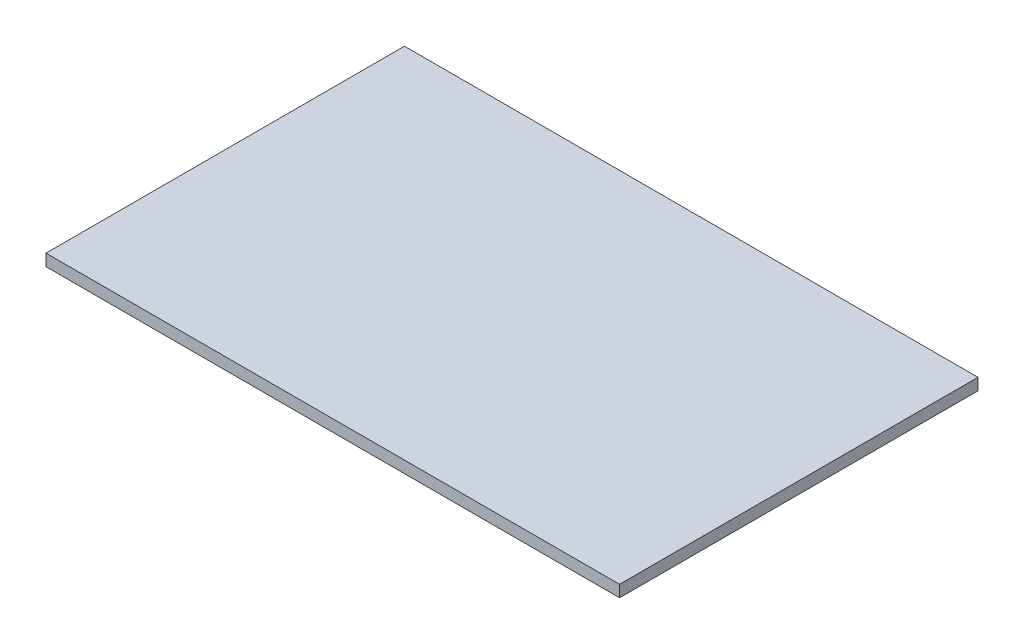
ISO-10303-21;
HEADER;
FILE_DESCRIPTION(('STEP AP214'),'2;1');
FILE_NAME('part.step','',(''),(''),'','','');
FILE_SCHEMA(('AUTOMOTIVE_DESIGN { 1 0 10303 214 1 1 1 1 }'));
ENDSEC;
DATA;
#1=APPLICATION_CONTEXT('core data for automotive mechanical design processes');
#2=APPLICATION_PROTOCOL_DEFINITION('international standard','automotive_design',2000,#1);
#3=PRODUCT_CONTEXT('',#1,'mechanical');
#4=PRODUCT('Part','Part','',(#3));
#5=PRODUCT_RELATED_PRODUCT_CATEGORY('part','',(#4));
#6=PRODUCT_DEFINITION_FORMATION('','',#4);
#7=PRODUCT_DEFINITION_CONTEXT('part definition',#1,'design');
#8=PRODUCT_DEFINITION('design','',#6,#7);
#9=PRODUCT_DEFINITION_SHAPE('','',#8);
#10=(LENGTH_UNIT() NAMED_UNIT(*) SI_UNIT(.MILLI.,.METRE.));
#11=(NAMED_UNIT(*) PLANE_ANGLE_UNIT() SI_UNIT($,.RADIAN.));
#12=(NAMED_UNIT(*) SI_UNIT($,.STERADIAN.) SOLID_ANGLE_UNIT());
#13=UNCERTAINTY_MEASURE_WITH_UNIT(LENGTH_MEASURE(1.E-05),#10,'distance_accuracy_value','');
#14=(GEOMETRIC_REPRESENTATION_CONTEXT(3) GLOBAL_UNCERTAINTY_ASSIGNED_CONTEXT((#13)) GLOBAL_UNIT_ASSIGNED_CONTEXT((#10,
#11,#12)) REPRESENTATION_CONTEXT('',''));
#15=CARTESIAN_POINT('',(0.,0.,0.));
#16=DIRECTION('',(0.,0.,1.));
#17=DIRECTION('',(1.,0.,0.));
#18=AXIS2_PLACEMENT_3D('',#15,#16,#17);
#19=CARTESIAN_POINT('',(-440.,18.,275.));
#20=DIRECTION('',(1.,0.,0.));
#21=DIRECTION('',(0.,0.,-1.));
#22=AXIS2_PLACEMENT_3D('',#19,#20,#21);
#23=PLANE('',#22);
#24=DIRECTION('',(0.,0.,1.));
#25=VECTOR('',#24,1.);
#26=CARTESIAN_POINT('',(-440.,0.,275.));
#27=LINE('',#26,#25);
#28=CARTESIAN_POINT('',(-440.,0.,-275.));
#29=VERTEX_POINT('',#28);
#30=CARTESIAN_POINT('',(-440.,0.,275.));
#31=VERTEX_POINT('',#30);
#32=EDGE_CURVE('E98',#29,#31,#27,.T.);
#33=ORIENTED_EDGE('',*,*,#32,.T.);
#34=DIRECTION('',(0.,-1.,0.));
#35=VECTOR('',#34,1.);
#36=CARTESIAN_POINT('',(-440.,18.,275.));
#37=LINE('',#36,#35);
#38=CARTESIAN_POINT('',(-440.,18.,275.));
#39=VERTEX_POINT('',#38);
#40=EDGE_CURVE('E11',#39,#31,#37,.T.);
#41=ORIENTED_EDGE('',*,*,#40,.F.);
#42=DIRECTION('',(0.,0.,1.));
#43=VECTOR('',#42,1.);
#44=CARTESIAN_POINT('',(-440.,18.,275.));
#45=LINE('',#44,#43);
#46=CARTESIAN_POINT('',(-440.,18.,-275.));
#47=VERTEX_POINT('',#46);
#48=EDGE_CURVE('E86',#47,#39,#45,.T.);
#49=ORIENTED_EDGE('',*,*,#48,.F.);
#50=DIRECTION('',(0.,-1.,0.));
#51=VECTOR('',#50,1.);
#52=CARTESIAN_POINT('',(-440.,18.,-275.));
#53=LINE('',#52,#51);
#54=EDGE_CURVE('E94',#47,#29,#53,.T.);
#55=ORIENTED_EDGE('',*,*,#54,.T.);
#56=EDGE_LOOP('',(#33,#41,#49,#55));
#57=FACE_BOUND('',#56,.T.);
#58=ADVANCED_FACE('F35',(#57),#23,.F.);
#59=CARTESIAN_POINT('',(440.,18.,275.));
#60=DIRECTION('',(0.,0.,-1.));
#61=DIRECTION('',(-1.,0.,0.));
#62=AXIS2_PLACEMENT_3D('',#59,#60,#61);
#63=PLANE('',#62);
#64=DIRECTION('',(1.,0.,0.));
#65=VECTOR('',#64,1.);
#66=CARTESIAN_POINT('',(440.,0.,275.));
#67=LINE('',#66,#65);
#68=CARTESIAN_POINT('',(440.,0.,275.));
#69=VERTEX_POINT('',#68);
#70=EDGE_CURVE('E90',#31,#69,#67,.T.);
#71=ORIENTED_EDGE('',*,*,#70,.T.);
#72=DIRECTION('',(0.,-1.,0.));
#73=VECTOR('',#72,1.);
#74=CARTESIAN_POINT('',(440.,18.,275.));
#75=LINE('',#74,#73);
#76=CARTESIAN_POINT('',(440.,18.,275.));
#77=VERTEX_POINT('',#76);
#78=EDGE_CURVE('E43',#77,#69,#75,.T.);
#79=ORIENTED_EDGE('',*,*,#78,.F.);
#80=DIRECTION('',(1.,0.,0.));
#81=VECTOR('',#80,1.);
#82=CARTESIAN_POINT('',(440.,18.,275.));
#83=LINE('',#82,#81);
#84=EDGE_CURVE('E81',#39,#77,#83,.T.);
#85=ORIENTED_EDGE('',*,*,#84,.F.);
#86=ORIENTED_EDGE('',*,*,#40,.T.);
#87=EDGE_LOOP('',(#71,#79,#85,#86));
#88=FACE_BOUND('',#87,.T.);
#89=ADVANCED_FACE('F89',(#88),#63,.F.);
#90=CARTESIAN_POINT('',(440.,18.,275.));
#91=DIRECTION('',(-1.,0.,0.));
#92=DIRECTION('',(0.,0.,1.));
#93=AXIS2_PLACEMENT_3D('',#90,#91,#92);
#94=PLANE('',#93);
#95=DIRECTION('',(0.,0.,-1.));
#96=VECTOR('',#95,1.);
#97=CARTESIAN_POINT('',(440.,0.,275.));
#98=LINE('',#97,#96);
#99=CARTESIAN_POINT('',(440.,0.,-275.));
#100=VERTEX_POINT('',#99);
#101=EDGE_CURVE('E68',#69,#100,#98,.T.);
#102=ORIENTED_EDGE('',*,*,#101,.T.);
#103=DIRECTION('',(0.,-1.,0.));
#104=VECTOR('',#103,1.);
#105=CARTESIAN_POINT('',(440.,18.,-275.));
#106=LINE('',#105,#104);
#107=CARTESIAN_POINT('',(440.,18.,-275.));
#108=VERTEX_POINT('',#107);
#109=EDGE_CURVE('E91',#108,#100,#106,.T.);
#110=ORIENTED_EDGE('',*,*,#109,.F.);
#111=DIRECTION('',(0.,0.,-1.));
#112=VECTOR('',#111,1.);
#113=CARTESIAN_POINT('',(440.,18.,275.));
#114=LINE('',#113,#112);
#115=EDGE_CURVE('E84',#77,#108,#114,.T.);
#116=ORIENTED_EDGE('',*,*,#115,.F.);
#117=ORIENTED_EDGE('',*,*,#78,.T.);
#118=EDGE_LOOP('',(#102,#110,#116,#117));
#119=FACE_BOUND('',#118,.T.);
#120=ADVANCED_FACE('F92',(#119),#94,.F.);
#121=CARTESIAN_POINT('',(440.,18.,-275.));
#122=DIRECTION('',(0.,0.,1.));
#123=DIRECTION('',(1.,0.,0.));
#124=AXIS2_PLACEMENT_3D('',#121,#122,#123);
#125=PLANE('',#124);
#126=DIRECTION('',(-1.,0.,0.));
#127=VECTOR('',#126,1.);
#128=CARTESIAN_POINT('',(440.,0.,-275.));
#129=LINE('',#128,#127);
#130=EDGE_CURVE('E74',#100,#29,#129,.T.);
#131=ORIENTED_EDGE('',*,*,#130,.T.);
#132=ORIENTED_EDGE('',*,*,#54,.F.);
#133=DIRECTION('',(-1.,0.,0.));
#134=VECTOR('',#133,1.);
#135=CARTESIAN_POINT('',(440.,18.,-275.));
#136=LINE('',#135,#134);
#137=EDGE_CURVE('E51',#108,#47,#136,.T.);
#138=ORIENTED_EDGE('',*,*,#137,.F.);
#139=ORIENTED_EDGE('',*,*,#109,.T.);
#140=EDGE_LOOP('',(#131,#132,#138,#139));
#141=FACE_BOUND('',#140,.T.);
#142=ADVANCED_FACE('F105',(#141),#125,.F.);
#143=CARTESIAN_POINT('',(0.,18.,0.));
#144=DIRECTION('',(0.,1.,0.));
#145=DIRECTION('',(0.,0.,1.));
#146=AXIS2_PLACEMENT_3D('',#143,#144,#145);
#147=PLANE('',#146);
#148=ORIENTED_EDGE('',*,*,#48,.T.);
#149=ORIENTED_EDGE('',*,*,#84,.T.);
#150=ORIENTED_EDGE('',*,*,#115,.T.);
#151=ORIENTED_EDGE('',*,*,#137,.T.);
#152=EDGE_LOOP('',(#148,#149,#150,#151));
#153=FACE_BOUND('',#152,.T.);
#154=ADVANCED_FACE('F82',(#153),#147,.T.);
#155=CARTESIAN_POINT('',(0.,0.,0.));
#156=DIRECTION('',(0.,1.,0.));
#157=DIRECTION('',(0.,0.,1.));
#158=AXIS2_PLACEMENT_3D('',#155,#156,#157);
#159=PLANE('',#158);
#160=ORIENTED_EDGE('',*,*,#32,.F.);
#161=ORIENTED_EDGE('',*,*,#130,.F.);
#162=ORIENTED_EDGE('',*,*,#101,.F.);
#163=ORIENTED_EDGE('',*,*,#70,.F.);
#164=EDGE_LOOP('',(#160,#161,#162,#163));
#165=FACE_BOUND('',#164,.T.);
#166=ADVANCED_FACE('F108',(#165),#159,.F.);
#167=CLOSED_SHELL('',(#58,#89,#120,#142,#154,#166));
#168=MANIFOLD_SOLID_BREP('B2',#167);
#169=ADVANCED_BREP_SHAPE_REPRESENTATION('',(#18,#168),#14);
#170=SHAPE_DEFINITION_REPRESENTATION(#9,#169);
ENDSEC;
END-ISO-10303-21;
